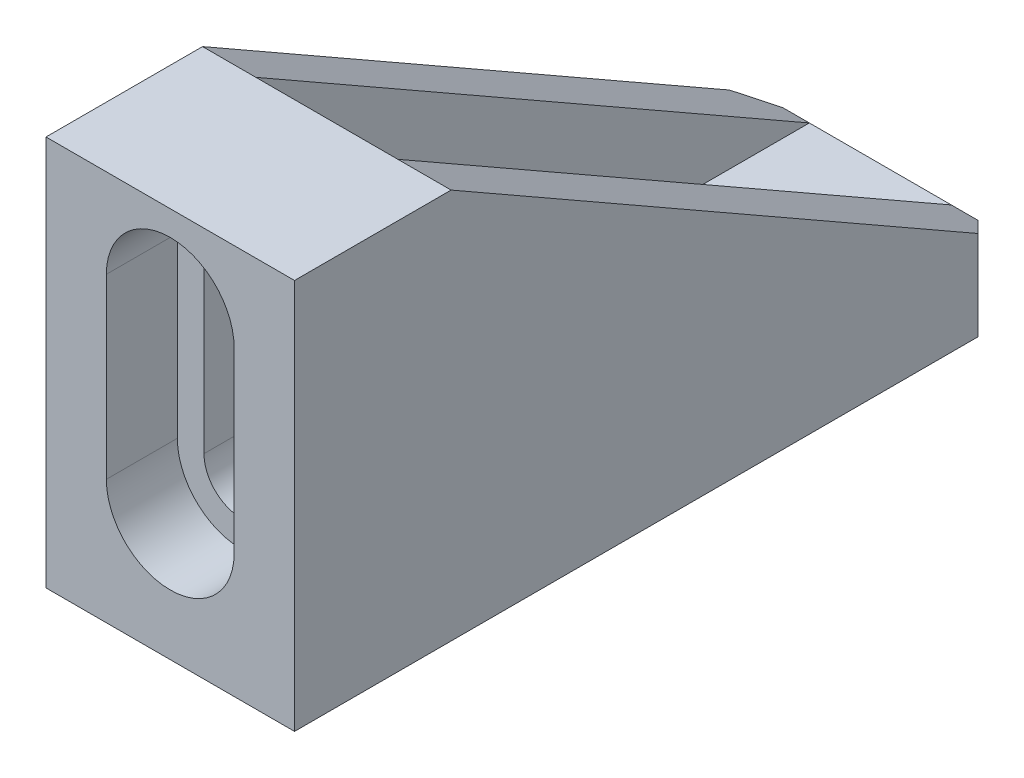
ISO-10303-21;
HEADER;
FILE_DESCRIPTION(('STEP AP214'),'2;1');
FILE_NAME('part.step','',(''),(''),'','','');
FILE_SCHEMA(('AUTOMOTIVE_DESIGN { 1 0 10303 214 1 1 1 1 }'));
ENDSEC;
DATA;
#1=APPLICATION_CONTEXT('core data for automotive mechanical design processes');
#2=APPLICATION_PROTOCOL_DEFINITION('international standard','automotive_design',2000,#1);
#3=PRODUCT_CONTEXT('',#1,'mechanical');
#4=PRODUCT('Part','Part','',(#3));
#5=PRODUCT_RELATED_PRODUCT_CATEGORY('part','',(#4));
#6=PRODUCT_DEFINITION_FORMATION('','',#4);
#7=PRODUCT_DEFINITION_CONTEXT('part definition',#1,'design');
#8=PRODUCT_DEFINITION('design','',#6,#7);
#9=PRODUCT_DEFINITION_SHAPE('','',#8);
#10=(LENGTH_UNIT() NAMED_UNIT(*) SI_UNIT(.MILLI.,.METRE.));
#11=(NAMED_UNIT(*) PLANE_ANGLE_UNIT() SI_UNIT($,.RADIAN.));
#12=(NAMED_UNIT(*) SI_UNIT($,.STERADIAN.) SOLID_ANGLE_UNIT());
#13=UNCERTAINTY_MEASURE_WITH_UNIT(LENGTH_MEASURE(1.E-05),#10,'distance_accuracy_value','');
#14=(GEOMETRIC_REPRESENTATION_CONTEXT(3) GLOBAL_UNCERTAINTY_ASSIGNED_CONTEXT((#13)) GLOBAL_UNIT_ASSIGNED_CONTEXT((#10,
#11,#12)) REPRESENTATION_CONTEXT('',''));
#15=CARTESIAN_POINT('',(0.,0.,0.));
#16=DIRECTION('',(0.,0.,1.));
#17=DIRECTION('',(1.,0.,0.));
#18=AXIS2_PLACEMENT_3D('',#15,#16,#17);
#19=CARTESIAN_POINT('',(0.,-2.81658631023967,0.));
#20=DIRECTION('',(0.,1.,0.));
#21=DIRECTION('',(0.,0.,1.));
#22=AXIS2_PLACEMENT_3D('',#19,#20,#21);
#23=PLANE('',#22);
#24=DIRECTION('',(0.,0.,1.));
#25=VECTOR('',#24,1.);
#26=CARTESIAN_POINT('',(-4.,-2.81658631023967,0.));
#27=LINE('',#26,#25);
#28=CARTESIAN_POINT('',(-4.,-2.81658631023967,0.));
#29=VERTEX_POINT('',#28);
#30=CARTESIAN_POINT('',(-4.,-2.81658631023967,9.18086413082004));
#31=VERTEX_POINT('',#30);
#32=EDGE_CURVE('E251',#29,#31,#27,.T.);
#33=ORIENTED_EDGE('',*,*,#32,.T.);
#34=CARTESIAN_POINT('',(0.,-2.81658631023967,9.18086413082004));
#35=DIRECTION('',(0.,1.,0.));
#36=DIRECTION('',(0.,0.,1.));
#37=AXIS2_PLACEMENT_3D('',#34,#35,#36);
#38=CIRCLE('',#37,4.00000000000002);
#39=CARTESIAN_POINT('',(4.,-2.81658631023967,9.18086413082004));
#40=VERTEX_POINT('',#39);
#41=EDGE_CURVE('E384',#31,#40,#38,.F.);
#42=ORIENTED_EDGE('',*,*,#41,.T.);
#43=DIRECTION('',(0.,0.,-1.));
#44=VECTOR('',#43,1.);
#45=CARTESIAN_POINT('',(4.,-2.81658631023967,0.));
#46=LINE('',#45,#44);
#47=CARTESIAN_POINT('',(4.,-2.81658631023967,0.));
#48=VERTEX_POINT('',#47);
#49=EDGE_CURVE('E260',#40,#48,#46,.T.);
#50=ORIENTED_EDGE('',*,*,#49,.T.);
#51=DIRECTION('',(-1.,0.,0.));
#52=VECTOR('',#51,1.);
#53=CARTESIAN_POINT('',(-4.,-2.81658631023967,0.));
#54=LINE('',#53,#52);
#55=EDGE_CURVE('E265',#48,#29,#54,.T.);
#56=ORIENTED_EDGE('',*,*,#55,.T.);
#57=EDGE_LOOP('',(#33,#42,#50,#56));
#58=FACE_BOUND('',#57,.T.);
#59=ADVANCED_FACE('F37',(#58),#23,.T.);
#60=CARTESIAN_POINT('',(4.,-2.81658631023967,25.18086413082));
#61=VERTEX_POINT('',#60);
#62=EDGE_CURVE('E266',#61,#40,#46,.T.);
#63=ORIENTED_EDGE('',*,*,#62,.T.);
#64=CARTESIAN_POINT('',(0.,-2.81658631023967,9.18086413082004));
#65=DIRECTION('',(0.,1.,0.));
#66=DIRECTION('',(0.,0.,1.));
#67=AXIS2_PLACEMENT_3D('',#64,#65,#66);
#68=CIRCLE('',#67,4.00000000000002);
#69=EDGE_CURVE('E382',#40,#31,#68,.F.);
#70=ORIENTED_EDGE('',*,*,#69,.T.);
#71=CARTESIAN_POINT('',(-3.99999999999999,-2.81658631023967,25.18086413082));
#72=VERTEX_POINT('',#71);
#73=EDGE_CURVE('E255',#31,#72,#27,.T.);
#74=ORIENTED_EDGE('',*,*,#73,.T.);
#75=CARTESIAN_POINT('',(0.,-2.81658631023967,25.18086413082));
#76=DIRECTION('',(0.,1.,0.));
#77=DIRECTION('',(0.,0.,1.));
#78=AXIS2_PLACEMENT_3D('',#75,#76,#77);
#79=CIRCLE('',#78,4.00000000000002);
#80=EDGE_CURVE('E379',#72,#61,#79,.F.);
#81=ORIENTED_EDGE('',*,*,#80,.T.);
#82=EDGE_LOOP('',(#63,#70,#74,#81));
#83=FACE_BOUND('',#82,.T.);
#84=ADVANCED_FACE('F457',(#83),#23,.T.);
#85=CARTESIAN_POINT('',(-7.,15.,31.18086413082));
#86=DIRECTION('',(0.,-0.868255740738426,0.496116890132525));
#87=DIRECTION('',(0.,-0.496116890132525,-0.868255740738426));
#88=AXIS2_PLACEMENT_3D('',#85,#86,#87);
#89=PLANE('',#88);
#90=DIRECTION('',(1.,0.,0.));
#91=VECTOR('',#90,1.);
#92=CARTESIAN_POINT('',(-7.,-2.81658631023967,0.));
#93=LINE('',#92,#91);
#94=CARTESIAN_POINT('',(-5.49999999999999,-2.81658631023967,0.));
#95=VERTEX_POINT('',#94);
#96=EDGE_CURVE('E281',#95,#29,#93,.T.);
#97=ORIENTED_EDGE('',*,*,#96,.F.);
#98=DIRECTION('',(0.655615492254349,-0.374615339558028,-0.655615492254349));
#99=VECTOR('',#98,1.);
#100=CARTESIAN_POINT('',(-9.20048415734678,-0.702148586434677,3.70048415734679));
#101=LINE('',#100,#99);
#102=CARTESIAN_POINT('',(-7.,-1.95949398100739,1.5));
#103=VERTEX_POINT('',#102);
#104=EDGE_CURVE('E401',#95,#103,#101,.F.);
#105=ORIENTED_EDGE('',*,*,#104,.T.);
#106=DIRECTION('',(0.,-0.496116890132525,-0.868255740738426));
#107=VECTOR('',#106,1.);
#108=CARTESIAN_POINT('',(-7.,15.,31.18086413082));
#109=LINE('',#108,#107);
#110=CARTESIAN_POINT('',(-7.,15.,31.18086413082));
#111=VERTEX_POINT('',#110);
#112=EDGE_CURVE('E276',#111,#103,#109,.T.);
#113=ORIENTED_EDGE('',*,*,#112,.F.);
#114=DIRECTION('',(1.,0.,0.));
#115=VECTOR('',#114,1.);
#116=CARTESIAN_POINT('',(-7.,15.,31.18086413082));
#117=LINE('',#116,#115);
#118=CARTESIAN_POINT('',(-4.,15.,31.18086413082));
#119=VERTEX_POINT('',#118);
#120=EDGE_CURVE('E285',#111,#119,#117,.T.);
#121=ORIENTED_EDGE('',*,*,#120,.T.);
#122=DIRECTION('',(0.,-0.496116890132525,-0.868255740738426));
#123=VECTOR('',#122,1.);
#124=CARTESIAN_POINT('',(-3.99999999999999,15.,31.18086413082));
#125=LINE('',#124,#123);
#126=EDGE_CURVE('E369',#119,#29,#125,.T.);
#127=ORIENTED_EDGE('',*,*,#126,.T.);
#128=EDGE_LOOP('',(#97,#105,#113,#121,#127));
#129=FACE_BOUND('',#128,.T.);
#130=ADVANCED_FACE('F437',(#129),#89,.F.);
#131=CARTESIAN_POINT('',(0.,0.,40.));
#132=DIRECTION('',(0.,0.,-1.));
#133=DIRECTION('',(-1.,0.,0.));
#134=AXIS2_PLACEMENT_3D('',#131,#132,#133);
#135=CYLINDRICAL_SURFACE('',#134,2.1);
#136=CARTESIAN_POINT('',(0.,0.,33.));
#137=DIRECTION('',(0.,0.,1.));
#138=DIRECTION('',(1.,0.,0.));
#139=AXIS2_PLACEMENT_3D('',#136,#137,#138);
#140=CIRCLE('',#139,2.1);
#141=CARTESIAN_POINT('',(-2.1,0.,33.));
#142=VERTEX_POINT('',#141);
#143=CARTESIAN_POINT('',(2.1,0.,33.));
#144=VERTEX_POINT('',#143);
#145=EDGE_CURVE('E248',#142,#144,#140,.T.);
#146=ORIENTED_EDGE('',*,*,#145,.F.);
#147=DIRECTION('',(0.,0.,-1.));
#148=VECTOR('',#147,1.);
#149=CARTESIAN_POINT('',(-2.1,0.,40.));
#150=LINE('',#149,#148);
#151=CARTESIAN_POINT('',(-2.1,0.,36.));
#152=VERTEX_POINT('',#151);
#153=EDGE_CURVE('E328',#152,#142,#150,.T.);
#154=ORIENTED_EDGE('',*,*,#153,.F.);
#155=CARTESIAN_POINT('',(0.,0.,36.));
#156=DIRECTION('',(0.,0.,1.));
#157=DIRECTION('',(1.,0.,0.));
#158=AXIS2_PLACEMENT_3D('',#155,#156,#157);
#159=CIRCLE('',#158,2.1);
#160=CARTESIAN_POINT('',(2.1,0.,36.));
#161=VERTEX_POINT('',#160);
#162=EDGE_CURVE('E325',#152,#161,#159,.T.);
#163=ORIENTED_EDGE('',*,*,#162,.T.);
#164=DIRECTION('',(0.,0.,-1.));
#165=VECTOR('',#164,1.);
#166=CARTESIAN_POINT('',(2.1,0.,40.));
#167=LINE('',#166,#165);
#168=EDGE_CURVE('E337',#161,#144,#167,.T.);
#169=ORIENTED_EDGE('',*,*,#168,.T.);
#170=EDGE_LOOP('',(#146,#154,#163,#169));
#171=FACE_BOUND('',#170,.T.);
#172=ADVANCED_FACE('F552',(#171),#135,.F.);
#173=CARTESIAN_POINT('',(2.1,0.,40.));
#174=DIRECTION('',(-1.,0.,0.));
#175=DIRECTION('',(0.,0.,1.));
#176=AXIS2_PLACEMENT_3D('',#173,#174,#175);
#177=PLANE('',#176);
#178=DIRECTION('',(0.,1.,0.));
#179=VECTOR('',#178,1.);
#180=CARTESIAN_POINT('',(2.1,0.,33.));
#181=LINE('',#180,#179);
#182=CARTESIAN_POINT('',(2.1,10.,33.));
#183=VERTEX_POINT('',#182);
#184=EDGE_CURVE('E246',#144,#183,#181,.T.);
#185=ORIENTED_EDGE('',*,*,#184,.F.);
#186=ORIENTED_EDGE('',*,*,#168,.F.);
#187=DIRECTION('',(0.,1.,0.));
#188=VECTOR('',#187,1.);
#189=CARTESIAN_POINT('',(2.1,0.,36.));
#190=LINE('',#189,#188);
#191=CARTESIAN_POINT('',(2.1,10.,36.));
#192=VERTEX_POINT('',#191);
#193=EDGE_CURVE('E322',#161,#192,#190,.T.);
#194=ORIENTED_EDGE('',*,*,#193,.T.);
#195=DIRECTION('',(0.,0.,-1.));
#196=VECTOR('',#195,1.);
#197=CARTESIAN_POINT('',(2.1,10.,40.));
#198=LINE('',#197,#196);
#199=EDGE_CURVE('E334',#192,#183,#198,.T.);
#200=ORIENTED_EDGE('',*,*,#199,.T.);
#201=EDGE_LOOP('',(#185,#186,#194,#200));
#202=FACE_BOUND('',#201,.T.);
#203=ADVANCED_FACE('F548',(#202),#177,.T.);
#204=CARTESIAN_POINT('',(0.,10.,40.));
#205=DIRECTION('',(0.,0.,-1.));
#206=DIRECTION('',(-1.,0.,0.));
#207=AXIS2_PLACEMENT_3D('',#204,#205,#206);
#208=CYLINDRICAL_SURFACE('',#207,2.1);
#209=CARTESIAN_POINT('',(0.,10.,33.));
#210=DIRECTION('',(0.,0.,1.));
#211=DIRECTION('',(1.,0.,0.));
#212=AXIS2_PLACEMENT_3D('',#209,#210,#211);
#213=CIRCLE('',#212,2.1);
#214=CARTESIAN_POINT('',(-2.1,10.,33.));
#215=VERTEX_POINT('',#214);
#216=EDGE_CURVE('E244',#183,#215,#213,.T.);
#217=ORIENTED_EDGE('',*,*,#216,.F.);
#218=ORIENTED_EDGE('',*,*,#199,.F.);
#219=CARTESIAN_POINT('',(0.,10.,36.));
#220=DIRECTION('',(0.,0.,1.));
#221=DIRECTION('',(1.,0.,0.));
#222=AXIS2_PLACEMENT_3D('',#219,#220,#221);
#223=CIRCLE('',#222,2.1);
#224=CARTESIAN_POINT('',(-2.1,10.,36.));
#225=VERTEX_POINT('',#224);
#226=EDGE_CURVE('E313',#192,#225,#223,.T.);
#227=ORIENTED_EDGE('',*,*,#226,.T.);
#228=DIRECTION('',(0.,0.,-1.));
#229=VECTOR('',#228,1.);
#230=CARTESIAN_POINT('',(-2.1,10.,40.));
#231=LINE('',#230,#229);
#232=EDGE_CURVE('E331',#225,#215,#231,.T.);
#233=ORIENTED_EDGE('',*,*,#232,.T.);
#234=EDGE_LOOP('',(#217,#218,#227,#233));
#235=FACE_BOUND('',#234,.T.);
#236=ADVANCED_FACE('F544',(#235),#208,.F.);
#237=CARTESIAN_POINT('',(-2.1,0.,40.));
#238=DIRECTION('',(1.,0.,0.));
#239=DIRECTION('',(0.,0.,-1.));
#240=AXIS2_PLACEMENT_3D('',#237,#238,#239);
#241=PLANE('',#240);
#242=DIRECTION('',(0.,-1.,0.));
#243=VECTOR('',#242,1.);
#244=CARTESIAN_POINT('',(-2.1,0.,33.));
#245=LINE('',#244,#243);
#246=EDGE_CURVE('E372',#215,#142,#245,.T.);
#247=ORIENTED_EDGE('',*,*,#246,.F.);
#248=ORIENTED_EDGE('',*,*,#232,.F.);
#249=DIRECTION('',(0.,-1.,0.));
#250=VECTOR('',#249,1.);
#251=CARTESIAN_POINT('',(-2.1,0.,36.));
#252=LINE('',#251,#250);
#253=EDGE_CURVE('E363',#225,#152,#252,.T.);
#254=ORIENTED_EDGE('',*,*,#253,.T.);
#255=ORIENTED_EDGE('',*,*,#153,.T.);
#256=EDGE_LOOP('',(#247,#248,#254,#255));
#257=FACE_BOUND('',#256,.T.);
#258=ADVANCED_FACE('F541',(#257),#241,.T.);
#259=CARTESIAN_POINT('',(0.,0.,40.));
#260=DIRECTION('',(0.,0.,1.));
#261=DIRECTION('',(1.,0.,0.));
#262=AXIS2_PLACEMENT_3D('',#259,#260,#261);
#263=PLANE('',#262);
#264=CARTESIAN_POINT('',(0.,0.,40.));
#265=DIRECTION('',(0.,0.,1.));
#266=DIRECTION('',(1.,0.,0.));
#267=AXIS2_PLACEMENT_3D('',#264,#265,#266);
#268=CIRCLE('',#267,3.6);
#269=CARTESIAN_POINT('',(-3.6,0.,40.));
#270=VERTEX_POINT('',#269);
#271=CARTESIAN_POINT('',(3.6,0.,40.));
#272=VERTEX_POINT('',#271);
#273=EDGE_CURVE('E283',#270,#272,#268,.T.);
#274=ORIENTED_EDGE('',*,*,#273,.F.);
#275=DIRECTION('',(0.,-1.,0.));
#276=VECTOR('',#275,1.);
#277=CARTESIAN_POINT('',(-3.6,0.,40.));
#278=LINE('',#277,#276);
#279=CARTESIAN_POINT('',(-3.6,10.,40.));
#280=VERTEX_POINT('',#279);
#281=EDGE_CURVE('E292',#280,#270,#278,.T.);
#282=ORIENTED_EDGE('',*,*,#281,.F.);
#283=CARTESIAN_POINT('',(0.,10.,40.));
#284=DIRECTION('',(0.,0.,1.));
#285=DIRECTION('',(1.,0.,0.));
#286=AXIS2_PLACEMENT_3D('',#283,#284,#285);
#287=CIRCLE('',#286,3.6);
#288=CARTESIAN_POINT('',(3.6,10.,40.));
#289=VERTEX_POINT('',#288);
#290=EDGE_CURVE('E306',#289,#280,#287,.T.);
#291=ORIENTED_EDGE('',*,*,#290,.F.);
#292=DIRECTION('',(0.,1.,0.));
#293=VECTOR('',#292,1.);
#294=CARTESIAN_POINT('',(3.6,0.,40.));
#295=LINE('',#294,#293);
#296=EDGE_CURVE('E303',#272,#289,#295,.T.);
#297=ORIENTED_EDGE('',*,*,#296,.F.);
#298=EDGE_LOOP('',(#274,#282,#291,#297));
#299=FACE_BOUND('',#298,.T.);
#300=DIRECTION('',(0.,1.,0.));
#301=VECTOR('',#300,1.);
#302=CARTESIAN_POINT('',(7.,7.,40.));
#303=LINE('',#302,#301);
#304=CARTESIAN_POINT('',(7.,-7.,40.));
#305=VERTEX_POINT('',#304);
#306=CARTESIAN_POINT('',(7.,15.,40.));
#307=VERTEX_POINT('',#306);
#308=EDGE_CURVE('E341',#305,#307,#303,.T.);
#309=ORIENTED_EDGE('',*,*,#308,.T.);
#310=DIRECTION('',(-1.,0.,0.));
#311=VECTOR('',#310,1.);
#312=CARTESIAN_POINT('',(-7.,15.,40.));
#313=LINE('',#312,#311);
#314=CARTESIAN_POINT('',(-7.,15.,40.));
#315=VERTEX_POINT('',#314);
#316=EDGE_CURVE('E343',#307,#315,#313,.T.);
#317=ORIENTED_EDGE('',*,*,#316,.T.);
#318=DIRECTION('',(0.,-1.,0.));
#319=VECTOR('',#318,1.);
#320=CARTESIAN_POINT('',(-7.,7.,40.));
#321=LINE('',#320,#319);
#322=CARTESIAN_POINT('',(-7.,-7.,40.));
#323=VERTEX_POINT('',#322);
#324=EDGE_CURVE('E345',#315,#323,#321,.T.);
#325=ORIENTED_EDGE('',*,*,#324,.T.);
#326=DIRECTION('',(1.,0.,0.));
#327=VECTOR('',#326,1.);
#328=CARTESIAN_POINT('',(-7.,-7.,40.));
#329=LINE('',#328,#327);
#330=EDGE_CURVE('E347',#323,#305,#329,.T.);
#331=ORIENTED_EDGE('',*,*,#330,.T.);
#332=EDGE_LOOP('',(#309,#317,#325,#331));
#333=FACE_BOUND('',#332,.T.);
#334=ADVANCED_FACE('F419',(#299,#333),#263,.T.);
#335=CARTESIAN_POINT('',(0.,0.,0.));
#336=DIRECTION('',(0.,0.,1.));
#337=DIRECTION('',(1.,0.,0.));
#338=AXIS2_PLACEMENT_3D('',#335,#336,#337);
#339=PLANE('',#338);
#340=DIRECTION('',(1.,0.,0.));
#341=VECTOR('',#340,1.);
#342=CARTESIAN_POINT('',(-7.,-7.,0.));
#343=LINE('',#342,#341);
#344=CARTESIAN_POINT('',(-5.49999999999999,-7.,0.));
#345=VERTEX_POINT('',#344);
#346=CARTESIAN_POINT('',(5.49999999999998,-7.,0.));
#347=VERTEX_POINT('',#346);
#348=EDGE_CURVE('E340',#345,#347,#343,.T.);
#349=ORIENTED_EDGE('',*,*,#348,.F.);
#350=DIRECTION('',(0.,1.,0.));
#351=VECTOR('',#350,1.);
#352=CARTESIAN_POINT('',(-5.49999999999999,0.,0.));
#353=LINE('',#352,#351);
#354=EDGE_CURVE('E399',#345,#95,#353,.T.);
#355=ORIENTED_EDGE('',*,*,#354,.T.);
#356=ORIENTED_EDGE('',*,*,#96,.T.);
#357=ORIENTED_EDGE('',*,*,#55,.F.);
#358=CARTESIAN_POINT('',(5.49999999999998,-2.81658631023967,0.));
#359=VERTEX_POINT('',#358);
#360=EDGE_CURVE('E284',#48,#359,#93,.T.);
#361=ORIENTED_EDGE('',*,*,#360,.T.);
#362=DIRECTION('',(0.,-1.,0.));
#363=VECTOR('',#362,1.);
#364=CARTESIAN_POINT('',(5.49999999999999,0.,0.));
#365=LINE('',#364,#363);
#366=EDGE_CURVE('E397',#359,#347,#365,.T.);
#367=ORIENTED_EDGE('',*,*,#366,.T.);
#368=EDGE_LOOP('',(#349,#355,#356,#357,#361,#367));
#369=FACE_BOUND('',#368,.T.);
#370=ADVANCED_FACE('F427',(#369),#339,.F.);
#371=CARTESIAN_POINT('',(7.,15.,40.));
#372=DIRECTION('',(-1.,0.,0.));
#373=DIRECTION('',(0.,-1.,0.));
#374=AXIS2_PLACEMENT_3D('',#371,#372,#373);
#375=PLANE('',#374);
#376=DIRECTION('',(0.,0.,-1.));
#377=VECTOR('',#376,1.);
#378=CARTESIAN_POINT('',(7.,-7.,40.));
#379=LINE('',#378,#377);
#380=CARTESIAN_POINT('',(7.,-7.,1.50000000000001));
#381=VERTEX_POINT('',#380);
#382=EDGE_CURVE('E349',#305,#381,#379,.T.);
#383=ORIENTED_EDGE('',*,*,#382,.T.);
#384=DIRECTION('',(0.,1.,0.));
#385=VECTOR('',#384,1.);
#386=CARTESIAN_POINT('',(7.,15.,1.50000000000001));
#387=LINE('',#386,#385);
#388=CARTESIAN_POINT('',(6.99999999999999,-1.9594939810074,1.5));
#389=VERTEX_POINT('',#388);
#390=EDGE_CURVE('E46',#381,#389,#387,.T.);
#391=ORIENTED_EDGE('',*,*,#390,.T.);
#392=DIRECTION('',(0.,-0.496116890132525,-0.868255740738426));
#393=VECTOR('',#392,1.);
#394=CARTESIAN_POINT('',(7.,15.,31.18086413082));
#395=LINE('',#394,#393);
#396=CARTESIAN_POINT('',(7.,15.,31.18086413082));
#397=VERTEX_POINT('',#396);
#398=EDGE_CURVE('E274',#397,#389,#395,.T.);
#399=ORIENTED_EDGE('',*,*,#398,.F.);
#400=DIRECTION('',(0.,0.,-1.));
#401=VECTOR('',#400,1.);
#402=CARTESIAN_POINT('',(7.,15.,40.));
#403=LINE('',#402,#401);
#404=EDGE_CURVE('E360',#307,#397,#403,.T.);
#405=ORIENTED_EDGE('',*,*,#404,.F.);
#406=ORIENTED_EDGE('',*,*,#308,.F.);
#407=EDGE_LOOP('',(#383,#391,#399,#405,#406));
#408=FACE_BOUND('',#407,.T.);
#409=ADVANCED_FACE('F404',(#408),#375,.F.);
#410=CARTESIAN_POINT('',(-7.,15.,40.));
#411=DIRECTION('',(0.,-1.,0.));
#412=DIRECTION('',(0.,0.,-1.));
#413=AXIS2_PLACEMENT_3D('',#410,#411,#412);
#414=PLANE('',#413);
#415=ORIENTED_EDGE('',*,*,#404,.T.);
#416=CARTESIAN_POINT('',(4.00000000000001,15.,31.18086413082));
#417=VERTEX_POINT('',#416);
#418=EDGE_CURVE('E279',#417,#397,#117,.T.);
#419=ORIENTED_EDGE('',*,*,#418,.F.);
#420=DIRECTION('',(1.,0.,0.));
#421=VECTOR('',#420,1.);
#422=CARTESIAN_POINT('',(-3.99999999999999,15.,31.18086413082));
#423=LINE('',#422,#421);
#424=EDGE_CURVE('E250',#119,#417,#423,.T.);
#425=ORIENTED_EDGE('',*,*,#424,.F.);
#426=ORIENTED_EDGE('',*,*,#120,.F.);
#427=DIRECTION('',(0.,0.,-1.));
#428=VECTOR('',#427,1.);
#429=CARTESIAN_POINT('',(-7.,15.,40.));
#430=LINE('',#429,#428);
#431=EDGE_CURVE('E357',#315,#111,#430,.T.);
#432=ORIENTED_EDGE('',*,*,#431,.F.);
#433=ORIENTED_EDGE('',*,*,#316,.F.);
#434=EDGE_LOOP('',(#415,#419,#425,#426,#432,#433));
#435=FACE_BOUND('',#434,.T.);
#436=ADVANCED_FACE('F414',(#435),#414,.F.);
#437=CARTESIAN_POINT('',(-7.,7.,40.));
#438=DIRECTION('',(1.,0.,0.));
#439=DIRECTION('',(0.,0.,-1.));
#440=AXIS2_PLACEMENT_3D('',#437,#438,#439);
#441=PLANE('',#440);
#442=ORIENTED_EDGE('',*,*,#112,.T.);
#443=DIRECTION('',(0.,-1.,0.));
#444=VECTOR('',#443,1.);
#445=CARTESIAN_POINT('',(-7.,7.,1.50000000000001));
#446=LINE('',#445,#444);
#447=CARTESIAN_POINT('',(-7.,-7.,1.50000000000001));
#448=VERTEX_POINT('',#447);
#449=EDGE_CURVE('E390',#103,#448,#446,.T.);
#450=ORIENTED_EDGE('',*,*,#449,.T.);
#451=DIRECTION('',(0.,0.,-1.));
#452=VECTOR('',#451,1.);
#453=CARTESIAN_POINT('',(-7.,-7.,40.));
#454=LINE('',#453,#452);
#455=EDGE_CURVE('E354',#323,#448,#454,.T.);
#456=ORIENTED_EDGE('',*,*,#455,.F.);
#457=ORIENTED_EDGE('',*,*,#324,.F.);
#458=ORIENTED_EDGE('',*,*,#431,.T.);
#459=EDGE_LOOP('',(#442,#450,#456,#457,#458));
#460=FACE_BOUND('',#459,.T.);
#461=ADVANCED_FACE('F564',(#460),#441,.F.);
#462=CARTESIAN_POINT('',(-7.,-7.,40.));
#463=DIRECTION('',(0.,1.,0.));
#464=DIRECTION('',(-1.,0.,0.));
#465=AXIS2_PLACEMENT_3D('',#462,#463,#464);
#466=PLANE('',#465);
#467=CARTESIAN_POINT('',(0.,-7.,9.18086413082004));
#468=DIRECTION('',(0.,1.,0.));
#469=DIRECTION('',(0.,0.,1.));
#470=AXIS2_PLACEMENT_3D('',#467,#468,#469);
#471=CIRCLE('',#470,2.5);
#472=CARTESIAN_POINT('',(0.,-7.,11.68086413082));
#473=VERTEX_POINT('',#472);
#474=EDGE_CURVE('E468',#473,#473,#471,.T.);
#475=ORIENTED_EDGE('',*,*,#474,.T.);
#476=EDGE_LOOP('',(#475));
#477=FACE_BOUND('',#476,.T.);
#478=CARTESIAN_POINT('',(0.,-7.,25.18086413082));
#479=DIRECTION('',(0.,1.,0.));
#480=DIRECTION('',(0.,0.,1.));
#481=AXIS2_PLACEMENT_3D('',#478,#479,#480);
#482=CIRCLE('',#481,2.5);
#483=CARTESIAN_POINT('',(0.,-7.,27.68086413082));
#484=VERTEX_POINT('',#483);
#485=EDGE_CURVE('E470',#484,#484,#482,.T.);
#486=ORIENTED_EDGE('',*,*,#485,.T.);
#487=EDGE_LOOP('',(#486));
#488=FACE_BOUND('',#487,.T.);
#489=ORIENTED_EDGE('',*,*,#455,.T.);
#490=DIRECTION('',(-0.707106781186548,0.,0.707106781186548));
#491=VECTOR('',#490,1.);
#492=CARTESIAN_POINT('',(-7.,-7.,1.50000000000001));
#493=LINE('',#492,#491);
#494=EDGE_CURVE('E395',#448,#345,#493,.F.);
#495=ORIENTED_EDGE('',*,*,#494,.T.);
#496=ORIENTED_EDGE('',*,*,#348,.T.);
#497=DIRECTION('',(-0.707106781186548,0.,-0.707106781186547));
#498=VECTOR('',#497,1.);
#499=CARTESIAN_POINT('',(7.,-7.,1.50000000000001));
#500=LINE('',#499,#498);
#501=EDGE_CURVE('E393',#347,#381,#500,.F.);
#502=ORIENTED_EDGE('',*,*,#501,.T.);
#503=ORIENTED_EDGE('',*,*,#382,.F.);
#504=ORIENTED_EDGE('',*,*,#330,.F.);
#505=EDGE_LOOP('',(#489,#495,#496,#502,#503,#504));
#506=FACE_BOUND('',#505,.T.);
#507=ADVANCED_FACE('F424',(#477,#488,#506),#466,.F.);
#508=CARTESIAN_POINT('',(0.,0.,36.));
#509=DIRECTION('',(0.,0.,1.));
#510=DIRECTION('',(1.,0.,0.));
#511=AXIS2_PLACEMENT_3D('',#508,#509,#510);
#512=CYLINDRICAL_SURFACE('',#511,3.6);
#513=ORIENTED_EDGE('',*,*,#273,.T.);
#514=DIRECTION('',(0.,0.,1.));
#515=VECTOR('',#514,1.);
#516=CARTESIAN_POINT('',(3.6,0.,36.));
#517=LINE('',#516,#515);
#518=CARTESIAN_POINT('',(3.6,0.,36.));
#519=VERTEX_POINT('',#518);
#520=EDGE_CURVE('E301',#519,#272,#517,.T.);
#521=ORIENTED_EDGE('',*,*,#520,.F.);
#522=CARTESIAN_POINT('',(0.,0.,36.));
#523=DIRECTION('',(0.,0.,1.));
#524=DIRECTION('',(1.,0.,0.));
#525=AXIS2_PLACEMENT_3D('',#522,#523,#524);
#526=CIRCLE('',#525,3.6);
#527=CARTESIAN_POINT('',(-3.6,0.,36.));
#528=VERTEX_POINT('',#527);
#529=EDGE_CURVE('E288',#528,#519,#526,.T.);
#530=ORIENTED_EDGE('',*,*,#529,.F.);
#531=DIRECTION('',(0.,0.,1.));
#532=VECTOR('',#531,1.);
#533=CARTESIAN_POINT('',(-3.6,0.,36.));
#534=LINE('',#533,#532);
#535=EDGE_CURVE('E311',#528,#270,#534,.T.);
#536=ORIENTED_EDGE('',*,*,#535,.T.);
#537=EDGE_LOOP('',(#513,#521,#530,#536));
#538=FACE_BOUND('',#537,.T.);
#539=ADVANCED_FACE('F530',(#538),#512,.F.);
#540=CARTESIAN_POINT('',(-3.6,0.,36.));
#541=DIRECTION('',(-1.,0.,0.));
#542=DIRECTION('',(0.,0.,1.));
#543=AXIS2_PLACEMENT_3D('',#540,#541,#542);
#544=PLANE('',#543);
#545=ORIENTED_EDGE('',*,*,#281,.T.);
#546=ORIENTED_EDGE('',*,*,#535,.F.);
#547=DIRECTION('',(0.,-1.,0.));
#548=VECTOR('',#547,1.);
#549=CARTESIAN_POINT('',(-3.6,0.,36.));
#550=LINE('',#549,#548);
#551=CARTESIAN_POINT('',(-3.6,10.,36.));
#552=VERTEX_POINT('',#551);
#553=EDGE_CURVE('E298',#552,#528,#550,.T.);
#554=ORIENTED_EDGE('',*,*,#553,.F.);
#555=DIRECTION('',(0.,0.,1.));
#556=VECTOR('',#555,1.);
#557=CARTESIAN_POINT('',(-3.6,10.,36.));
#558=LINE('',#557,#556);
#559=EDGE_CURVE('E314',#552,#280,#558,.T.);
#560=ORIENTED_EDGE('',*,*,#559,.T.);
#561=EDGE_LOOP('',(#545,#546,#554,#560));
#562=FACE_BOUND('',#561,.T.);
#563=ADVANCED_FACE('F526',(#562),#544,.F.);
#564=CARTESIAN_POINT('',(0.,10.,36.));
#565=DIRECTION('',(0.,0.,1.));
#566=DIRECTION('',(1.,0.,0.));
#567=AXIS2_PLACEMENT_3D('',#564,#565,#566);
#568=CYLINDRICAL_SURFACE('',#567,3.6);
#569=ORIENTED_EDGE('',*,*,#290,.T.);
#570=ORIENTED_EDGE('',*,*,#559,.F.);
#571=CARTESIAN_POINT('',(0.,10.,36.));
#572=DIRECTION('',(0.,0.,1.));
#573=DIRECTION('',(1.,0.,0.));
#574=AXIS2_PLACEMENT_3D('',#571,#572,#573);
#575=CIRCLE('',#574,3.6);
#576=CARTESIAN_POINT('',(3.6,10.,36.));
#577=VERTEX_POINT('',#576);
#578=EDGE_CURVE('E295',#577,#552,#575,.T.);
#579=ORIENTED_EDGE('',*,*,#578,.F.);
#580=DIRECTION('',(0.,0.,1.));
#581=VECTOR('',#580,1.);
#582=CARTESIAN_POINT('',(3.6,10.,36.));
#583=LINE('',#582,#581);
#584=EDGE_CURVE('E316',#577,#289,#583,.T.);
#585=ORIENTED_EDGE('',*,*,#584,.T.);
#586=EDGE_LOOP('',(#569,#570,#579,#585));
#587=FACE_BOUND('',#586,.T.);
#588=ADVANCED_FACE('F529',(#587),#568,.F.);
#589=CARTESIAN_POINT('',(3.6,0.,36.));
#590=DIRECTION('',(1.,0.,0.));
#591=DIRECTION('',(0.,0.,-1.));
#592=AXIS2_PLACEMENT_3D('',#589,#590,#591);
#593=PLANE('',#592);
#594=ORIENTED_EDGE('',*,*,#296,.T.);
#595=ORIENTED_EDGE('',*,*,#584,.F.);
#596=DIRECTION('',(0.,1.,0.));
#597=VECTOR('',#596,1.);
#598=CARTESIAN_POINT('',(3.6,0.,36.));
#599=LINE('',#598,#597);
#600=EDGE_CURVE('E291',#519,#577,#599,.T.);
#601=ORIENTED_EDGE('',*,*,#600,.F.);
#602=ORIENTED_EDGE('',*,*,#520,.T.);
#603=EDGE_LOOP('',(#594,#595,#601,#602));
#604=FACE_BOUND('',#603,.T.);
#605=ADVANCED_FACE('F524',(#604),#593,.F.);
#606=CARTESIAN_POINT('',(0.,0.,36.));
#607=DIRECTION('',(0.,0.,1.));
#608=DIRECTION('',(1.,0.,0.));
#609=AXIS2_PLACEMENT_3D('',#606,#607,#608);
#610=PLANE('',#609);
#611=ORIENTED_EDGE('',*,*,#253,.F.);
#612=ORIENTED_EDGE('',*,*,#226,.F.);
#613=ORIENTED_EDGE('',*,*,#193,.F.);
#614=ORIENTED_EDGE('',*,*,#162,.F.);
#615=EDGE_LOOP('',(#611,#612,#613,#614));
#616=FACE_BOUND('',#615,.T.);
#617=ORIENTED_EDGE('',*,*,#529,.T.);
#618=ORIENTED_EDGE('',*,*,#600,.T.);
#619=ORIENTED_EDGE('',*,*,#578,.T.);
#620=ORIENTED_EDGE('',*,*,#553,.T.);
#621=EDGE_LOOP('',(#617,#618,#619,#620));
#622=FACE_BOUND('',#621,.T.);
#623=ADVANCED_FACE('F521',(#616,#622),#610,.T.);
#624=ORIENTED_EDGE('',*,*,#398,.T.);
#625=DIRECTION('',(0.655615492254349,0.374615339558027,0.655615492254349));
#626=VECTOR('',#625,1.);
#627=CARTESIAN_POINT('',(11.1653131193497,0.420544634622724,5.66531311934972));
#628=LINE('',#627,#626);
#629=EDGE_CURVE('E12',#389,#359,#628,.F.);
#630=ORIENTED_EDGE('',*,*,#629,.T.);
#631=ORIENTED_EDGE('',*,*,#360,.F.);
#632=DIRECTION('',(0.,0.496116890132525,0.868255740738426));
#633=VECTOR('',#632,1.);
#634=CARTESIAN_POINT('',(4.00000000000001,15.,31.18086413082));
#635=LINE('',#634,#633);
#636=EDGE_CURVE('E366',#48,#417,#635,.T.);
#637=ORIENTED_EDGE('',*,*,#636,.T.);
#638=ORIENTED_EDGE('',*,*,#418,.T.);
#639=EDGE_LOOP('',(#624,#630,#631,#637,#638));
#640=FACE_BOUND('',#639,.T.);
#641=ADVANCED_FACE('F409',(#640),#89,.F.);
#642=CARTESIAN_POINT('',(-4.,-2.81658631023967,0.));
#643=DIRECTION('',(-1.,0.,0.));
#644=DIRECTION('',(0.,0.,1.));
#645=AXIS2_PLACEMENT_3D('',#642,#643,#644);
#646=PLANE('',#645);
#647=DIRECTION('',(0.,1.,0.));
#648=VECTOR('',#647,1.);
#649=CARTESIAN_POINT('',(-3.99999999999999,-2.81658631023967,31.18086413082));
#650=LINE('',#649,#648);
#651=CARTESIAN_POINT('',(-3.99999999999999,-2.81658631023967,31.18086413082));
#652=VERTEX_POINT('',#651);
#653=EDGE_CURVE('E269',#652,#119,#650,.T.);
#654=ORIENTED_EDGE('',*,*,#653,.F.);
#655=EDGE_CURVE('E256',#72,#652,#27,.T.);
#656=ORIENTED_EDGE('',*,*,#655,.F.);
#657=ORIENTED_EDGE('',*,*,#73,.F.);
#658=ORIENTED_EDGE('',*,*,#32,.F.);
#659=ORIENTED_EDGE('',*,*,#126,.F.);
#660=EDGE_LOOP('',(#654,#656,#657,#658,#659));
#661=FACE_BOUND('',#660,.T.);
#662=ADVANCED_FACE('F441',(#661),#646,.F.);
#663=CARTESIAN_POINT('',(4.,-2.81658631023967,0.));
#664=DIRECTION('',(1.,0.,0.));
#665=DIRECTION('',(0.,0.,-1.));
#666=AXIS2_PLACEMENT_3D('',#663,#664,#665);
#667=PLANE('',#666);
#668=CARTESIAN_POINT('',(4.00000000000001,-2.81658631023967,31.18086413082));
#669=VERTEX_POINT('',#668);
#670=EDGE_CURVE('E262',#669,#61,#46,.T.);
#671=ORIENTED_EDGE('',*,*,#670,.F.);
#672=DIRECTION('',(0.,1.,0.));
#673=VECTOR('',#672,1.);
#674=CARTESIAN_POINT('',(4.00000000000001,-2.81658631023967,31.18086413082));
#675=LINE('',#674,#673);
#676=EDGE_CURVE('E272',#669,#417,#675,.T.);
#677=ORIENTED_EDGE('',*,*,#676,.T.);
#678=ORIENTED_EDGE('',*,*,#636,.F.);
#679=ORIENTED_EDGE('',*,*,#49,.F.);
#680=ORIENTED_EDGE('',*,*,#62,.F.);
#681=EDGE_LOOP('',(#671,#677,#678,#679,#680));
#682=FACE_BOUND('',#681,.T.);
#683=ADVANCED_FACE('F459',(#682),#667,.F.);
#684=CARTESIAN_POINT('',(-3.99999999999999,-2.81658631023967,31.18086413082));
#685=DIRECTION('',(0.,0.,1.));
#686=DIRECTION('',(1.,0.,0.));
#687=AXIS2_PLACEMENT_3D('',#684,#685,#686);
#688=PLANE('',#687);
#689=DIRECTION('',(1.,0.,0.));
#690=VECTOR('',#689,1.);
#691=CARTESIAN_POINT('',(-3.99999999999999,-2.81658631023967,31.18086413082));
#692=LINE('',#691,#690);
#693=CARTESIAN_POINT('',(3.45,-2.81658631023967,31.18086413082));
#694=VERTEX_POINT('',#693);
#695=EDGE_CURVE('E254',#694,#669,#692,.T.);
#696=ORIENTED_EDGE('',*,*,#695,.F.);
#697=DIRECTION('',(0.,-1.,0.));
#698=VECTOR('',#697,1.);
#699=CARTESIAN_POINT('',(3.45,13.45,31.18086413082));
#700=LINE('',#699,#698);
#701=CARTESIAN_POINT('',(3.45,13.45,31.18086413082));
#702=VERTEX_POINT('',#701);
#703=EDGE_CURVE('E230',#702,#694,#700,.T.);
#704=ORIENTED_EDGE('',*,*,#703,.F.);
#705=DIRECTION('',(1.,0.,0.));
#706=VECTOR('',#705,1.);
#707=CARTESIAN_POINT('',(3.45,13.45,31.18086413082));
#708=LINE('',#707,#706);
#709=CARTESIAN_POINT('',(-3.45,13.45,31.18086413082));
#710=VERTEX_POINT('',#709);
#711=EDGE_CURVE('E221',#710,#702,#708,.T.);
#712=ORIENTED_EDGE('',*,*,#711,.F.);
#713=DIRECTION('',(0.,1.,0.));
#714=VECTOR('',#713,1.);
#715=CARTESIAN_POINT('',(-3.45,13.45,31.18086413082));
#716=LINE('',#715,#714);
#717=CARTESIAN_POINT('',(-3.45,-2.81658631023967,31.18086413082));
#718=VERTEX_POINT('',#717);
#719=EDGE_CURVE('E465',#718,#710,#716,.T.);
#720=ORIENTED_EDGE('',*,*,#719,.F.);
#721=EDGE_CURVE('E257',#652,#718,#692,.T.);
#722=ORIENTED_EDGE('',*,*,#721,.F.);
#723=ORIENTED_EDGE('',*,*,#653,.T.);
#724=ORIENTED_EDGE('',*,*,#424,.T.);
#725=ORIENTED_EDGE('',*,*,#676,.F.);
#726=EDGE_LOOP('',(#696,#704,#712,#720,#722,#723,#724,#725));
#727=FACE_BOUND('',#726,.T.);
#728=ADVANCED_FACE('F463',(#727),#688,.F.);
#729=ORIENTED_EDGE('',*,*,#670,.T.);
#730=CARTESIAN_POINT('',(0.,-2.81658631023967,25.18086413082));
#731=DIRECTION('',(0.,1.,0.));
#732=DIRECTION('',(0.,0.,1.));
#733=AXIS2_PLACEMENT_3D('',#730,#731,#732);
#734=CIRCLE('',#733,4.00000000000002);
#735=EDGE_CURVE('E377',#61,#72,#734,.F.);
#736=ORIENTED_EDGE('',*,*,#735,.T.);
#737=ORIENTED_EDGE('',*,*,#655,.T.);
#738=ORIENTED_EDGE('',*,*,#721,.T.);
#739=EDGE_CURVE('E261',#718,#694,#692,.T.);
#740=ORIENTED_EDGE('',*,*,#739,.T.);
#741=ORIENTED_EDGE('',*,*,#695,.T.);
#742=EDGE_LOOP('',(#729,#736,#737,#738,#740,#741));
#743=FACE_BOUND('',#742,.T.);
#744=ADVANCED_FACE('F449',(#743),#23,.T.);
#745=CARTESIAN_POINT('',(0.,0.,33.));
#746=DIRECTION('',(0.,0.,1.));
#747=DIRECTION('',(1.,0.,0.));
#748=AXIS2_PLACEMENT_3D('',#745,#746,#747);
#749=PLANE('',#748);
#750=ORIENTED_EDGE('',*,*,#145,.T.);
#751=ORIENTED_EDGE('',*,*,#184,.T.);
#752=ORIENTED_EDGE('',*,*,#216,.T.);
#753=ORIENTED_EDGE('',*,*,#246,.T.);
#754=EDGE_LOOP('',(#750,#751,#752,#753));
#755=FACE_BOUND('',#754,.T.);
#756=DIRECTION('',(0.,1.,0.));
#757=VECTOR('',#756,1.);
#758=CARTESIAN_POINT('',(-3.45,13.45,33.));
#759=LINE('',#758,#757);
#760=CARTESIAN_POINT('',(-3.45,-3.45,33.));
#761=VERTEX_POINT('',#760);
#762=CARTESIAN_POINT('',(-3.45,13.45,33.));
#763=VERTEX_POINT('',#762);
#764=EDGE_CURVE('E225',#761,#763,#759,.T.);
#765=ORIENTED_EDGE('',*,*,#764,.T.);
#766=DIRECTION('',(1.,0.,0.));
#767=VECTOR('',#766,1.);
#768=CARTESIAN_POINT('',(3.45,13.45,33.));
#769=LINE('',#768,#767);
#770=CARTESIAN_POINT('',(3.45,13.45,33.));
#771=VERTEX_POINT('',#770);
#772=EDGE_CURVE('E218',#763,#771,#769,.T.);
#773=ORIENTED_EDGE('',*,*,#772,.T.);
#774=DIRECTION('',(0.,-1.,0.));
#775=VECTOR('',#774,1.);
#776=CARTESIAN_POINT('',(3.45,13.45,33.));
#777=LINE('',#776,#775);
#778=CARTESIAN_POINT('',(3.45,-3.45,33.));
#779=VERTEX_POINT('',#778);
#780=EDGE_CURVE('E204',#771,#779,#777,.T.);
#781=ORIENTED_EDGE('',*,*,#780,.T.);
#782=DIRECTION('',(-1.,0.,0.));
#783=VECTOR('',#782,1.);
#784=CARTESIAN_POINT('',(3.45,-3.45,33.));
#785=LINE('',#784,#783);
#786=EDGE_CURVE('E239',#779,#761,#785,.T.);
#787=ORIENTED_EDGE('',*,*,#786,.T.);
#788=EDGE_LOOP('',(#765,#773,#781,#787));
#789=FACE_BOUND('',#788,.T.);
#790=ADVANCED_FACE('F224',(#755,#789),#749,.F.);
#791=CARTESIAN_POINT('',(0.,0.,31.18086413082));
#792=DIRECTION('',(0.,0.,-1.));
#793=DIRECTION('',(-1.,0.,0.));
#794=AXIS2_PLACEMENT_3D('',#791,#792,#793);
#795=PLANE('',#794);
#796=ORIENTED_EDGE('',*,*,#739,.F.);
#797=CARTESIAN_POINT('',(-3.45,-3.45,31.18086413082));
#798=VERTEX_POINT('',#797);
#799=EDGE_CURVE('E234',#798,#718,#716,.T.);
#800=ORIENTED_EDGE('',*,*,#799,.F.);
#801=DIRECTION('',(-1.,0.,0.));
#802=VECTOR('',#801,1.);
#803=CARTESIAN_POINT('',(3.45,-3.45,31.18086413082));
#804=LINE('',#803,#802);
#805=CARTESIAN_POINT('',(3.45,-3.45,31.18086413082));
#806=VERTEX_POINT('',#805);
#807=EDGE_CURVE('E227',#806,#798,#804,.T.);
#808=ORIENTED_EDGE('',*,*,#807,.F.);
#809=EDGE_CURVE('E477',#694,#806,#700,.T.);
#810=ORIENTED_EDGE('',*,*,#809,.F.);
#811=EDGE_LOOP('',(#796,#800,#808,#810));
#812=FACE_BOUND('',#811,.T.);
#813=ADVANCED_FACE('F485',(#812),#795,.F.);
#814=CARTESIAN_POINT('',(3.45,13.45,54.2543145584818));
#815=DIRECTION('',(0.,1.,0.));
#816=DIRECTION('',(0.,0.,1.));
#817=AXIS2_PLACEMENT_3D('',#814,#815,#816);
#818=PLANE('',#817);
#819=DIRECTION('',(0.,0.,-1.));
#820=VECTOR('',#819,1.);
#821=CARTESIAN_POINT('',(-3.45,13.45,54.2543145584818));
#822=LINE('',#821,#820);
#823=EDGE_CURVE('E237',#763,#710,#822,.T.);
#824=ORIENTED_EDGE('',*,*,#823,.T.);
#825=ORIENTED_EDGE('',*,*,#711,.T.);
#826=DIRECTION('',(0.,0.,-1.));
#827=VECTOR('',#826,1.);
#828=CARTESIAN_POINT('',(3.45,13.45,54.2543145584818));
#829=LINE('',#828,#827);
#830=EDGE_CURVE('E207',#771,#702,#829,.T.);
#831=ORIENTED_EDGE('',*,*,#830,.F.);
#832=ORIENTED_EDGE('',*,*,#772,.F.);
#833=EDGE_LOOP('',(#824,#825,#831,#832));
#834=FACE_BOUND('',#833,.T.);
#835=ADVANCED_FACE('F217',(#834),#818,.F.);
#836=CARTESIAN_POINT('',(3.45,13.45,54.2543145584818));
#837=DIRECTION('',(1.,0.,0.));
#838=DIRECTION('',(0.,0.,-1.));
#839=AXIS2_PLACEMENT_3D('',#836,#837,#838);
#840=PLANE('',#839);
#841=ORIENTED_EDGE('',*,*,#830,.T.);
#842=ORIENTED_EDGE('',*,*,#703,.T.);
#843=ORIENTED_EDGE('',*,*,#809,.T.);
#844=DIRECTION('',(0.,0.,-1.));
#845=VECTOR('',#844,1.);
#846=CARTESIAN_POINT('',(3.45,-3.45,54.2543145584818));
#847=LINE('',#846,#845);
#848=EDGE_CURVE('E210',#779,#806,#847,.T.);
#849=ORIENTED_EDGE('',*,*,#848,.F.);
#850=ORIENTED_EDGE('',*,*,#780,.F.);
#851=EDGE_LOOP('',(#841,#842,#843,#849,#850));
#852=FACE_BOUND('',#851,.T.);
#853=ADVANCED_FACE('F206',(#852),#840,.F.);
#854=CARTESIAN_POINT('',(3.45,-3.45,54.2543145584818));
#855=DIRECTION('',(0.,-1.,0.));
#856=DIRECTION('',(0.,0.,-1.));
#857=AXIS2_PLACEMENT_3D('',#854,#855,#856);
#858=PLANE('',#857);
#859=ORIENTED_EDGE('',*,*,#848,.T.);
#860=ORIENTED_EDGE('',*,*,#807,.T.);
#861=DIRECTION('',(0.,0.,-1.));
#862=VECTOR('',#861,1.);
#863=CARTESIAN_POINT('',(-3.45,-3.45,54.2543145584818));
#864=LINE('',#863,#862);
#865=EDGE_CURVE('E238',#761,#798,#864,.T.);
#866=ORIENTED_EDGE('',*,*,#865,.F.);
#867=ORIENTED_EDGE('',*,*,#786,.F.);
#868=EDGE_LOOP('',(#859,#860,#866,#867));
#869=FACE_BOUND('',#868,.T.);
#870=ADVANCED_FACE('F482',(#869),#858,.F.);
#871=CARTESIAN_POINT('',(-3.45,13.45,54.2543145584818));
#872=DIRECTION('',(-1.,0.,0.));
#873=DIRECTION('',(0.,-1.,0.));
#874=AXIS2_PLACEMENT_3D('',#871,#872,#873);
#875=PLANE('',#874);
#876=ORIENTED_EDGE('',*,*,#865,.T.);
#877=ORIENTED_EDGE('',*,*,#799,.T.);
#878=ORIENTED_EDGE('',*,*,#719,.T.);
#879=ORIENTED_EDGE('',*,*,#823,.F.);
#880=ORIENTED_EDGE('',*,*,#764,.F.);
#881=EDGE_LOOP('',(#876,#877,#878,#879,#880));
#882=FACE_BOUND('',#881,.T.);
#883=ADVANCED_FACE('F486',(#882),#875,.F.);
#884=CARTESIAN_POINT('',(0.,-7.,25.18086413082));
#885=DIRECTION('',(0.,1.,0.));
#886=DIRECTION('',(0.,0.,1.));
#887=AXIS2_PLACEMENT_3D('',#884,#885,#886);
#888=CYLINDRICAL_SURFACE('',#887,2.5);
#889=CARTESIAN_POINT('',(0.,-4.31658631023968,25.18086413082));
#890=DIRECTION('',(0.,1.,0.));
#891=DIRECTION('',(0.,0.,1.));
#892=AXIS2_PLACEMENT_3D('',#889,#890,#891);
#893=CIRCLE('',#892,2.5);
#894=CARTESIAN_POINT('',(0.,-4.31658631023968,27.68086413082));
#895=VERTEX_POINT('',#894);
#896=EDGE_CURVE('E387',#895,#895,#893,.T.);
#897=ORIENTED_EDGE('',*,*,#896,.T.);
#898=EDGE_LOOP('',(#897));
#899=FACE_BOUND('',#898,.T.);
#900=ORIENTED_EDGE('',*,*,#485,.F.);
#901=EDGE_LOOP('',(#900));
#902=FACE_BOUND('',#901,.T.);
#903=ADVANCED_FACE('F488',(#899,#902),#888,.F.);
#904=CARTESIAN_POINT('',(0.,-7.,9.18086413082004));
#905=DIRECTION('',(0.,1.,0.));
#906=DIRECTION('',(0.,0.,1.));
#907=AXIS2_PLACEMENT_3D('',#904,#905,#906);
#908=CYLINDRICAL_SURFACE('',#907,2.5);
#909=CARTESIAN_POINT('',(0.,-4.31658631023968,9.18086413082004));
#910=DIRECTION('',(0.,1.,0.));
#911=DIRECTION('',(0.,0.,1.));
#912=AXIS2_PLACEMENT_3D('',#909,#910,#911);
#913=CIRCLE('',#912,2.5);
#914=CARTESIAN_POINT('',(0.,-4.31658631023968,11.68086413082));
#915=VERTEX_POINT('',#914);
#916=EDGE_CURVE('E374',#915,#915,#913,.T.);
#917=ORIENTED_EDGE('',*,*,#916,.T.);
#918=EDGE_LOOP('',(#917));
#919=FACE_BOUND('',#918,.T.);
#920=ORIENTED_EDGE('',*,*,#474,.F.);
#921=EDGE_LOOP('',(#920));
#922=FACE_BOUND('',#921,.T.);
#923=ADVANCED_FACE('F494',(#919,#922),#908,.F.);
#924=CARTESIAN_POINT('',(0.,-4.31658631023968,9.18086413082004));
#925=DIRECTION('',(0.,1.,0.));
#926=DIRECTION('',(0.,0.,1.));
#927=AXIS2_PLACEMENT_3D('',#924,#925,#926);
#928=CONICAL_SURFACE('',#927,2.5,0.78539816339745);
#929=ORIENTED_EDGE('',*,*,#69,.F.);
#930=ORIENTED_EDGE('',*,*,#41,.F.);
#931=EDGE_LOOP('',(#929,#930));
#932=FACE_BOUND('',#931,.T.);
#933=ORIENTED_EDGE('',*,*,#916,.F.);
#934=EDGE_LOOP('',(#933));
#935=FACE_BOUND('',#934,.T.);
#936=ADVANCED_FACE('F573',(#932,#935),#928,.F.);
#937=CARTESIAN_POINT('',(0.,-4.31658631023968,25.18086413082));
#938=DIRECTION('',(0.,1.,0.));
#939=DIRECTION('',(0.,0.,1.));
#940=AXIS2_PLACEMENT_3D('',#937,#938,#939);
#941=CONICAL_SURFACE('',#940,2.5,0.78539816339745);
#942=ORIENTED_EDGE('',*,*,#735,.F.);
#943=ORIENTED_EDGE('',*,*,#80,.F.);
#944=EDGE_LOOP('',(#942,#943));
#945=FACE_BOUND('',#944,.T.);
#946=ORIENTED_EDGE('',*,*,#896,.F.);
#947=EDGE_LOOP('',(#946));
#948=FACE_BOUND('',#947,.T.);
#949=ADVANCED_FACE('F453',(#945,#948),#941,.F.);
#950=CARTESIAN_POINT('',(-7.,7.,1.50000000000001));
#951=DIRECTION('',(0.707106781186548,0.,0.707106781186548));
#952=DIRECTION('',(0.,-1.,0.));
#953=AXIS2_PLACEMENT_3D('',#950,#951,#952);
#954=PLANE('',#953);
#955=ORIENTED_EDGE('',*,*,#104,.F.);
#956=ORIENTED_EDGE('',*,*,#354,.F.);
#957=ORIENTED_EDGE('',*,*,#494,.F.);
#958=ORIENTED_EDGE('',*,*,#449,.F.);
#959=EDGE_LOOP('',(#955,#956,#957,#958));
#960=FACE_BOUND('',#959,.T.);
#961=ADVANCED_FACE('F584',(#960),#954,.F.);
#962=CARTESIAN_POINT('',(7.,15.,1.50000000000001));
#963=DIRECTION('',(-0.707106781186547,0.,0.707106781186548));
#964=DIRECTION('',(0.,1.,0.));
#965=AXIS2_PLACEMENT_3D('',#962,#963,#964);
#966=PLANE('',#965);
#967=ORIENTED_EDGE('',*,*,#501,.F.);
#968=ORIENTED_EDGE('',*,*,#366,.F.);
#969=ORIENTED_EDGE('',*,*,#629,.F.);
#970=ORIENTED_EDGE('',*,*,#390,.F.);
#971=EDGE_LOOP('',(#967,#968,#969,#970));
#972=FACE_BOUND('',#971,.T.);
#973=ADVANCED_FACE('F40',(#972),#966,.F.);
#974=CLOSED_SHELL('',(#59,#84,#130,#172,#203,#236,#258,#334,#370,#409,#436,#461,#507,#539,#563,
#588,#605,#623,#641,#662,#683,#728,#744,#790,#813,#835,#853,#870,#883,#903,#923,#936,#949,#961,#973));
#975=MANIFOLD_SOLID_BREP('B2',#974);
#976=ADVANCED_BREP_SHAPE_REPRESENTATION('',(#18,#975),#14);
#977=SHAPE_DEFINITION_REPRESENTATION(#9,#976);
ENDSEC;
END-ISO-10303-21;
